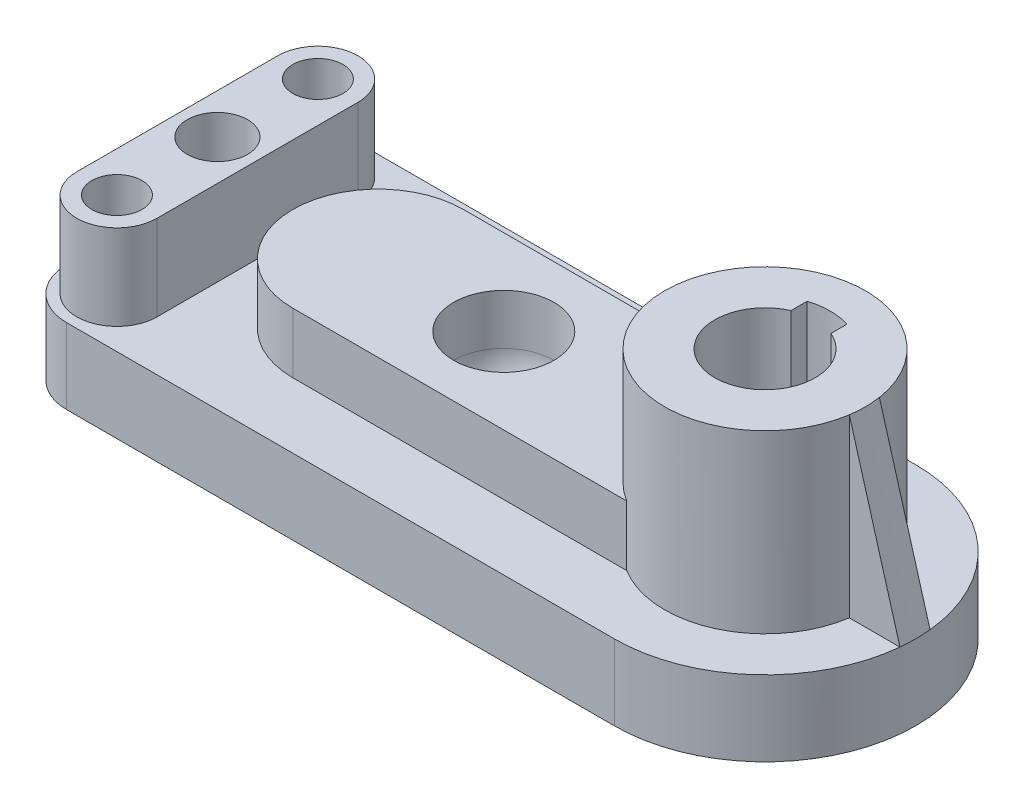
ISO-10303-21;
HEADER;
FILE_DESCRIPTION(('STEP AP214'),'2;1');
FILE_NAME('part.step','',(''),(''),'','','');
FILE_SCHEMA(('AUTOMOTIVE_DESIGN { 1 0 10303 214 1 1 1 1 }'));
ENDSEC;
DATA;
#1=APPLICATION_CONTEXT('core data for automotive mechanical design processes');
#2=APPLICATION_PROTOCOL_DEFINITION('international standard','automotive_design',2000,#1);
#3=PRODUCT_CONTEXT('',#1,'mechanical');
#4=PRODUCT('Part','Part','',(#3));
#5=PRODUCT_RELATED_PRODUCT_CATEGORY('part','',(#4));
#6=PRODUCT_DEFINITION_FORMATION('','',#4);
#7=PRODUCT_DEFINITION_CONTEXT('part definition',#1,'design');
#8=PRODUCT_DEFINITION('design','',#6,#7);
#9=PRODUCT_DEFINITION_SHAPE('','',#8);
#10=(LENGTH_UNIT() NAMED_UNIT(*) SI_UNIT(.MILLI.,.METRE.));
#11=(NAMED_UNIT(*) PLANE_ANGLE_UNIT() SI_UNIT($,.RADIAN.));
#12=(NAMED_UNIT(*) SI_UNIT($,.STERADIAN.) SOLID_ANGLE_UNIT());
#13=UNCERTAINTY_MEASURE_WITH_UNIT(LENGTH_MEASURE(1.E-05),#10,'distance_accuracy_value','');
#14=(GEOMETRIC_REPRESENTATION_CONTEXT(3) GLOBAL_UNCERTAINTY_ASSIGNED_CONTEXT((#13)) GLOBAL_UNIT_ASSIGNED_CONTEXT((#10,
#11,#12)) REPRESENTATION_CONTEXT('',''));
#15=CARTESIAN_POINT('',(0.,0.,0.));
#16=DIRECTION('',(0.,0.,1.));
#17=DIRECTION('',(1.,0.,0.));
#18=AXIS2_PLACEMENT_3D('',#15,#16,#17);
#19=CARTESIAN_POINT('',(119.,15.,-30.));
#20=DIRECTION('',(0.,-1.,0.));
#21=DIRECTION('',(0.,0.,-1.));
#22=AXIS2_PLACEMENT_3D('',#19,#20,#21);
#23=PLANE('',#22);
#24=CARTESIAN_POINT('',(10.,15.,-50.));
#25=DIRECTION('',(0.,1.,0.));
#26=DIRECTION('',(0.,0.,1.));
#27=AXIS2_PLACEMENT_3D('',#24,#25,#26);
#28=CIRCLE('',#27,8.00000000000001);
#29=CARTESIAN_POINT('',(18.,15.,-50.));
#30=VERTEX_POINT('',#29);
#31=CARTESIAN_POINT('',(1.99999999999997,15.,-50.));
#32=VERTEX_POINT('',#31);
#33=EDGE_CURVE('E309',#30,#32,#28,.T.);
#34=ORIENTED_EDGE('',*,*,#33,.F.);
#35=DIRECTION('',(0.,0.,-1.));
#36=VECTOR('',#35,1.);
#37=CARTESIAN_POINT('',(18.,15.,-50.));
#38=LINE('',#37,#36);
#39=CARTESIAN_POINT('',(18.,15.,-10.));
#40=VERTEX_POINT('',#39);
#41=EDGE_CURVE('E314',#40,#30,#38,.T.);
#42=ORIENTED_EDGE('',*,*,#41,.F.);
#43=CARTESIAN_POINT('',(10.,15.,-9.99999999999999));
#44=DIRECTION('',(0.,1.,0.));
#45=DIRECTION('',(0.,0.,1.));
#46=AXIS2_PLACEMENT_3D('',#43,#44,#45);
#47=CIRCLE('',#46,8.00000000000001);
#48=CARTESIAN_POINT('',(1.99999999999999,15.,-10.));
#49=VERTEX_POINT('',#48);
#50=EDGE_CURVE('E326',#49,#40,#47,.T.);
#51=ORIENTED_EDGE('',*,*,#50,.F.);
#52=DIRECTION('',(0.,0.,1.));
#53=VECTOR('',#52,1.);
#54=CARTESIAN_POINT('',(1.99999999999998,15.,-50.));
#55=LINE('',#54,#53);
#56=EDGE_CURVE('E323',#32,#49,#55,.T.);
#57=ORIENTED_EDGE('',*,*,#56,.F.);
#58=EDGE_LOOP('',(#34,#42,#51,#57));
#59=FACE_BOUND('',#58,.T.);
#60=DIRECTION('',(1.,0.,0.));
#61=VECTOR('',#60,1.);
#62=CARTESIAN_POINT('',(42.,15.,-13.));
#63=LINE('',#62,#61);
#64=CARTESIAN_POINT('',(42.,15.,-13.));
#65=VERTEX_POINT('',#64);
#66=CARTESIAN_POINT('',(108.464346247147,15.,-13.));
#67=VERTEX_POINT('',#66);
#68=EDGE_CURVE('E532',#65,#67,#63,.T.);
#69=ORIENTED_EDGE('',*,*,#68,.F.);
#70=CARTESIAN_POINT('',(42.,15.,-30.));
#71=DIRECTION('',(0.,1.,0.));
#72=DIRECTION('',(0.,0.,1.));
#73=AXIS2_PLACEMENT_3D('',#70,#71,#72);
#74=CIRCLE('',#73,17.);
#75=CARTESIAN_POINT('',(42.,15.,-47.));
#76=VERTEX_POINT('',#75);
#77=EDGE_CURVE('E214',#76,#65,#74,.T.);
#78=ORIENTED_EDGE('',*,*,#77,.F.);
#79=DIRECTION('',(-1.,0.,0.));
#80=VECTOR('',#79,1.);
#81=CARTESIAN_POINT('',(42.,15.,-47.));
#82=LINE('',#81,#80);
#83=CARTESIAN_POINT('',(108.464346247147,15.,-47.));
#84=VERTEX_POINT('',#83);
#85=EDGE_CURVE('E210',#84,#76,#82,.T.);
#86=ORIENTED_EDGE('',*,*,#85,.F.);
#87=CARTESIAN_POINT('',(119.,15.,-30.));
#88=DIRECTION('',(0.,-1.,0.));
#89=DIRECTION('',(0.,0.,-1.));
#90=AXIS2_PLACEMENT_3D('',#87,#88,#89);
#91=CIRCLE('',#90,20.);
#92=CARTESIAN_POINT('',(138.773719933285,15.,-33.));
#93=VERTEX_POINT('',#92);
#94=EDGE_CURVE('E472',#93,#84,#91,.F.);
#95=ORIENTED_EDGE('',*,*,#94,.F.);
#96=DIRECTION('',(-1.,0.,0.));
#97=VECTOR('',#96,1.);
#98=CARTESIAN_POINT('',(148.849623113199,15.,-33.));
#99=LINE('',#98,#97);
#100=CARTESIAN_POINT('',(148.848412759468,15.,-32.9999999997389));
#101=VERTEX_POINT('',#100);
#102=EDGE_CURVE('E463',#101,#93,#99,.T.);
#103=ORIENTED_EDGE('',*,*,#102,.F.);
#104=CARTESIAN_POINT('',(119.,15.,-30.));
#105=DIRECTION('',(0.,1.,0.));
#106=DIRECTION('',(0.,0.,-1.));
#107=AXIS2_PLACEMENT_3D('',#104,#105,#106);
#108=CIRCLE('',#107,30.);
#109=CARTESIAN_POINT('',(119.,15.,-60.));
#110=VERTEX_POINT('',#109);
#111=EDGE_CURVE('E349',#101,#110,#108,.T.);
#112=ORIENTED_EDGE('',*,*,#111,.T.);
#113=DIRECTION('',(-1.,0.,0.));
#114=VECTOR('',#113,1.);
#115=CARTESIAN_POINT('',(10.0000000000001,15.,-60.));
#116=LINE('',#115,#114);
#117=CARTESIAN_POINT('',(10.0000000000001,15.,-60.));
#118=VERTEX_POINT('',#117);
#119=EDGE_CURVE('E345',#110,#118,#116,.T.);
#120=ORIENTED_EDGE('',*,*,#119,.T.);
#121=CARTESIAN_POINT('',(10.,15.,-50.));
#122=DIRECTION('',(0.,1.,0.));
#123=DIRECTION('',(0.,0.,1.));
#124=AXIS2_PLACEMENT_3D('',#121,#122,#123);
#125=CIRCLE('',#124,10.);
#126=CARTESIAN_POINT('',(0.,15.,-49.9999999999999));
#127=VERTEX_POINT('',#126);
#128=EDGE_CURVE('E512',#118,#127,#125,.T.);
#129=ORIENTED_EDGE('',*,*,#128,.T.);
#130=DIRECTION('',(0.,0.,1.));
#131=VECTOR('',#130,1.);
#132=CARTESIAN_POINT('',(0.,15.,-10.0000000000001));
#133=LINE('',#132,#131);
#134=CARTESIAN_POINT('',(0.,15.,-10.0000000000001));
#135=VERTEX_POINT('',#134);
#136=EDGE_CURVE('E511',#127,#135,#133,.T.);
#137=ORIENTED_EDGE('',*,*,#136,.T.);
#138=CARTESIAN_POINT('',(10.,15.,-10.));
#139=DIRECTION('',(0.,1.,0.));
#140=DIRECTION('',(0.,0.,1.));
#141=AXIS2_PLACEMENT_3D('',#138,#139,#140);
#142=CIRCLE('',#141,10.);
#143=CARTESIAN_POINT('',(10.,15.,0.));
#144=VERTEX_POINT('',#143);
#145=EDGE_CURVE('E509',#135,#144,#142,.T.);
#146=ORIENTED_EDGE('',*,*,#145,.T.);
#147=DIRECTION('',(1.,0.,0.));
#148=VECTOR('',#147,1.);
#149=CARTESIAN_POINT('',(10.0000000000001,15.,0.));
#150=LINE('',#149,#148);
#151=CARTESIAN_POINT('',(119.,15.,0.));
#152=VERTEX_POINT('',#151);
#153=EDGE_CURVE('E495',#144,#152,#150,.T.);
#154=ORIENTED_EDGE('',*,*,#153,.T.);
#155=CARTESIAN_POINT('',(148.849623113199,15.,-27.));
#156=VERTEX_POINT('',#155);
#157=EDGE_CURVE('E353',#152,#156,#108,.T.);
#158=ORIENTED_EDGE('',*,*,#157,.T.);
#159=DIRECTION('',(1.,0.,0.));
#160=VECTOR('',#159,1.);
#161=CARTESIAN_POINT('',(148.849623113199,15.,-27.));
#162=LINE('',#161,#160);
#163=CARTESIAN_POINT('',(138.773719933285,15.,-27.));
#164=VERTEX_POINT('',#163);
#165=EDGE_CURVE('E253',#164,#156,#162,.T.);
#166=ORIENTED_EDGE('',*,*,#165,.F.);
#167=EDGE_CURVE('E476',#67,#164,#91,.F.);
#168=ORIENTED_EDGE('',*,*,#167,.F.);
#169=EDGE_LOOP('',(#69,#78,#86,#95,#103,#112,#120,#129,#137,#146,#154,#158,#166,#168));
#170=FACE_BOUND('',#169,.T.);
#171=ADVANCED_FACE('F45',(#59,#170),#23,.F.);
#172=CARTESIAN_POINT('',(119.,50.,-30.));
#173=DIRECTION('',(0.,-1.,0.));
#174=DIRECTION('',(0.,0.,-1.));
#175=AXIS2_PLACEMENT_3D('',#172,#173,#174);
#176=CYLINDRICAL_SURFACE('',#175,20.);
#177=DIRECTION('',(0.,-1.,0.));
#178=VECTOR('',#177,1.);
#179=CARTESIAN_POINT('',(108.464346247147,27.,-13.));
#180=LINE('',#179,#178);
#181=CARTESIAN_POINT('',(108.464346247147,27.,-13.));
#182=VERTEX_POINT('',#181);
#183=EDGE_CURVE('E61',#182,#67,#180,.T.);
#184=ORIENTED_EDGE('',*,*,#183,.T.);
#185=ORIENTED_EDGE('',*,*,#167,.T.);
#186=DIRECTION('',(0.,-1.,0.));
#187=VECTOR('',#186,1.);
#188=CARTESIAN_POINT('',(138.773719933285,50.,-27.));
#189=LINE('',#188,#187);
#190=CARTESIAN_POINT('',(138.773719933285,50.,-26.9999999999997));
#191=VERTEX_POINT('',#190);
#192=EDGE_CURVE('E249',#191,#164,#189,.T.);
#193=ORIENTED_EDGE('',*,*,#192,.F.);
#194=CARTESIAN_POINT('',(119.,50.,-30.));
#195=DIRECTION('',(0.,1.,0.));
#196=DIRECTION('',(0.,0.,1.));
#197=AXIS2_PLACEMENT_3D('',#194,#195,#196);
#198=CIRCLE('',#197,20.);
#199=CARTESIAN_POINT('',(138.773719933285,50.0000000000078,-33.));
#200=VERTEX_POINT('',#199);
#201=EDGE_CURVE('E282',#200,#191,#198,.T.);
#202=ORIENTED_EDGE('',*,*,#201,.F.);
#203=DIRECTION('',(0.,-1.,0.));
#204=VECTOR('',#203,1.);
#205=CARTESIAN_POINT('',(138.773719933285,50.,-33.));
#206=LINE('',#205,#204);
#207=CARTESIAN_POINT('',(138.773719933285,49.9429961550341,-33.));
#208=VERTEX_POINT('',#207);
#209=EDGE_CURVE('E254',#200,#208,#206,.T.);
#210=ORIENTED_EDGE('',*,*,#209,.T.);
#211=EDGE_CURVE('E252',#208,#93,#206,.T.);
#212=ORIENTED_EDGE('',*,*,#211,.T.);
#213=ORIENTED_EDGE('',*,*,#94,.T.);
#214=DIRECTION('',(0.,-1.,0.));
#215=VECTOR('',#214,1.);
#216=CARTESIAN_POINT('',(108.464346247147,27.,-47.));
#217=LINE('',#216,#215);
#218=CARTESIAN_POINT('',(108.464346247147,27.,-47.));
#219=VERTEX_POINT('',#218);
#220=EDGE_CURVE('E221',#219,#84,#217,.T.);
#221=ORIENTED_EDGE('',*,*,#220,.F.);
#222=CARTESIAN_POINT('',(119.,27.,-30.));
#223=DIRECTION('',(0.,-1.,0.));
#224=DIRECTION('',(0.,0.,-1.));
#225=AXIS2_PLACEMENT_3D('',#222,#223,#224);
#226=CIRCLE('',#225,20.);
#227=EDGE_CURVE('E200',#182,#219,#226,.T.);
#228=ORIENTED_EDGE('',*,*,#227,.F.);
#229=EDGE_LOOP('',(#184,#185,#193,#202,#210,#212,#213,#221,#228));
#230=FACE_BOUND('',#229,.T.);
#231=ADVANCED_FACE('F413',(#230),#176,.T.);
#232=CARTESIAN_POINT('',(119.,15.,-30.));
#233=DIRECTION('',(0.,-1.,0.));
#234=DIRECTION('',(0.,0.,-1.));
#235=AXIS2_PLACEMENT_3D('',#232,#233,#234);
#236=CYLINDRICAL_SURFACE('',#235,30.);
#237=CARTESIAN_POINT('',(148.683329026034,15.,-25.6200798372027));
#238=CARTESIAN_POINT('',(148.7461515347,15.,-26.0781329495942));
#239=CARTESIAN_POINT('',(148.80324498006,14.9999999999956,-26.5385432076493));
#240=CARTESIAN_POINT('',(148.929393058684,15.0000000000076,-27.7937012699372));
#241=CARTESIAN_POINT('',(148.977444297386,15.0000000000048,-28.5918725024124));
#242=CARTESIAN_POINT('',(149.001784624181,14.9999999999976,-29.790289799225));
#243=CARTESIAN_POINT('',(149.001941979064,14.9999999999976,-30.189955568258));
#244=CARTESIAN_POINT('',(148.986318105774,15.0000000000024,-30.9887494805969));
#245=CARTESIAN_POINT('',(148.970537510806,15.,-31.3878778418723));
#246=CARTESIAN_POINT('',(148.92300879648,15.,-32.1846717711496));
#247=CARTESIAN_POINT('',(148.889746147584,14.9999999999986,-32.5818173558762));
#248=CARTESIAN_POINT('',(148.809168960563,15.0000000000014,-33.3739863199389));
#249=CARTESIAN_POINT('',(148.761855052781,14.9999999999996,-33.7690099168121));
#250=CARTESIAN_POINT('',(148.606260132419,15.0000000000007,-34.9514708413386));
#251=CARTESIAN_POINT('',(148.484325915738,14.9999999999519,-35.7362983035718));
#252=CARTESIAN_POINT('',(148.363981386982,15.,-36.5191733820323));
#253=B_SPLINE_CURVE_WITH_KNOTS('',3,(#237,#238,#239,#240,#241,#242,#243,#244,#245,#246,#247,
#248,#249,#250,#251,#252),.UNSPECIFIED.,.F.,.F.,(4,2,2,2,2,2,2,4),(0.,0.126904169331537,
0.345178126998653,0.454315105832211,0.563452084665769,0.672589063499327,0.781726042332884,1.),.UNSPECIFIED.);
#254=EDGE_CURVE('E219',#156,#101,#253,.T.);
#255=ORIENTED_EDGE('',*,*,#254,.F.);
#256=ORIENTED_EDGE('',*,*,#157,.F.);
#257=DIRECTION('',(0.,-1.,0.));
#258=VECTOR('',#257,1.);
#259=CARTESIAN_POINT('',(119.,15.,0.));
#260=LINE('',#259,#258);
#261=CARTESIAN_POINT('',(119.,0.,0.));
#262=VERTEX_POINT('',#261);
#263=EDGE_CURVE('E492',#152,#262,#260,.T.);
#264=ORIENTED_EDGE('',*,*,#263,.T.);
#265=CARTESIAN_POINT('',(119.,0.,-30.));
#266=DIRECTION('',(0.,1.,0.));
#267=DIRECTION('',(0.,0.,-1.));
#268=AXIS2_PLACEMENT_3D('',#265,#266,#267);
#269=CIRCLE('',#268,30.);
#270=CARTESIAN_POINT('',(119.,0.,-60.));
#271=VERTEX_POINT('',#270);
#272=EDGE_CURVE('E342',#262,#271,#269,.T.);
#273=ORIENTED_EDGE('',*,*,#272,.T.);
#274=DIRECTION('',(0.,-1.,0.));
#275=VECTOR('',#274,1.);
#276=CARTESIAN_POINT('',(119.,15.,-60.));
#277=LINE('',#276,#275);
#278=EDGE_CURVE('E477',#110,#271,#277,.T.);
#279=ORIENTED_EDGE('',*,*,#278,.F.);
#280=ORIENTED_EDGE('',*,*,#111,.F.);
#281=EDGE_LOOP('',(#255,#256,#264,#273,#279,#280));
#282=FACE_BOUND('',#281,.T.);
#283=ADVANCED_FACE('F419',(#282),#236,.T.);
#284=CARTESIAN_POINT('',(10.0000000000001,15.,-60.));
#285=DIRECTION('',(0.,0.,1.));
#286=DIRECTION('',(1.,0.,0.));
#287=AXIS2_PLACEMENT_3D('',#284,#285,#286);
#288=PLANE('',#287);
#289=DIRECTION('',(-1.,0.,0.));
#290=VECTOR('',#289,1.);
#291=CARTESIAN_POINT('',(10.0000000000001,0.,-60.));
#292=LINE('',#291,#290);
#293=CARTESIAN_POINT('',(10.0000000000001,0.,-60.));
#294=VERTEX_POINT('',#293);
#295=EDGE_CURVE('E504',#271,#294,#292,.T.);
#296=ORIENTED_EDGE('',*,*,#295,.T.);
#297=DIRECTION('',(0.,-1.,0.));
#298=VECTOR('',#297,1.);
#299=CARTESIAN_POINT('',(10.0000000000001,15.,-60.));
#300=LINE('',#299,#298);
#301=EDGE_CURVE('E480',#118,#294,#300,.T.);
#302=ORIENTED_EDGE('',*,*,#301,.F.);
#303=ORIENTED_EDGE('',*,*,#119,.F.);
#304=ORIENTED_EDGE('',*,*,#278,.T.);
#305=EDGE_LOOP('',(#296,#302,#303,#304));
#306=FACE_BOUND('',#305,.T.);
#307=ADVANCED_FACE('F447',(#306),#288,.F.);
#308=CARTESIAN_POINT('',(10.,15.,-50.));
#309=DIRECTION('',(0.,-1.,0.));
#310=DIRECTION('',(0.,0.,-1.));
#311=AXIS2_PLACEMENT_3D('',#308,#309,#310);
#312=CYLINDRICAL_SURFACE('',#311,10.);
#313=CARTESIAN_POINT('',(10.,0.,-50.));
#314=DIRECTION('',(0.,1.,0.));
#315=DIRECTION('',(0.,0.,1.));
#316=AXIS2_PLACEMENT_3D('',#313,#314,#315);
#317=CIRCLE('',#316,10.);
#318=CARTESIAN_POINT('',(0.,0.,-49.9999999999999));
#319=VERTEX_POINT('',#318);
#320=EDGE_CURVE('E502',#294,#319,#317,.T.);
#321=ORIENTED_EDGE('',*,*,#320,.T.);
#322=DIRECTION('',(0.,-1.,0.));
#323=VECTOR('',#322,1.);
#324=CARTESIAN_POINT('',(0.,15.,-49.9999999999999));
#325=LINE('',#324,#323);
#326=EDGE_CURVE('E483',#127,#319,#325,.T.);
#327=ORIENTED_EDGE('',*,*,#326,.F.);
#328=ORIENTED_EDGE('',*,*,#128,.F.);
#329=ORIENTED_EDGE('',*,*,#301,.T.);
#330=EDGE_LOOP('',(#321,#327,#328,#329));
#331=FACE_BOUND('',#330,.T.);
#332=ADVANCED_FACE('F443',(#331),#312,.T.);
#333=CARTESIAN_POINT('',(0.,15.,-10.0000000000001));
#334=DIRECTION('',(1.,0.,0.));
#335=DIRECTION('',(0.,0.,-1.));
#336=AXIS2_PLACEMENT_3D('',#333,#334,#335);
#337=PLANE('',#336);
#338=DIRECTION('',(0.,0.,1.));
#339=VECTOR('',#338,1.);
#340=CARTESIAN_POINT('',(0.,0.,-10.0000000000001));
#341=LINE('',#340,#339);
#342=CARTESIAN_POINT('',(0.,0.,-10.0000000000001));
#343=VERTEX_POINT('',#342);
#344=EDGE_CURVE('E500',#319,#343,#341,.T.);
#345=ORIENTED_EDGE('',*,*,#344,.T.);
#346=DIRECTION('',(0.,-1.,0.));
#347=VECTOR('',#346,1.);
#348=CARTESIAN_POINT('',(0.,15.,-10.0000000000001));
#349=LINE('',#348,#347);
#350=EDGE_CURVE('E486',#135,#343,#349,.T.);
#351=ORIENTED_EDGE('',*,*,#350,.F.);
#352=ORIENTED_EDGE('',*,*,#136,.F.);
#353=ORIENTED_EDGE('',*,*,#326,.T.);
#354=EDGE_LOOP('',(#345,#351,#352,#353));
#355=FACE_BOUND('',#354,.T.);
#356=ADVANCED_FACE('F439',(#355),#337,.F.);
#357=CARTESIAN_POINT('',(10.,15.,-10.));
#358=DIRECTION('',(0.,-1.,0.));
#359=DIRECTION('',(0.,0.,-1.));
#360=AXIS2_PLACEMENT_3D('',#357,#358,#359);
#361=CYLINDRICAL_SURFACE('',#360,10.);
#362=CARTESIAN_POINT('',(10.,0.,-10.));
#363=DIRECTION('',(0.,1.,0.));
#364=DIRECTION('',(0.,0.,1.));
#365=AXIS2_PLACEMENT_3D('',#362,#363,#364);
#366=CIRCLE('',#365,10.);
#367=CARTESIAN_POINT('',(10.,0.,0.));
#368=VERTEX_POINT('',#367);
#369=EDGE_CURVE('E498',#343,#368,#366,.T.);
#370=ORIENTED_EDGE('',*,*,#369,.T.);
#371=DIRECTION('',(0.,-1.,0.));
#372=VECTOR('',#371,1.);
#373=CARTESIAN_POINT('',(10.,15.,0.));
#374=LINE('',#373,#372);
#375=EDGE_CURVE('E489',#144,#368,#374,.T.);
#376=ORIENTED_EDGE('',*,*,#375,.F.);
#377=ORIENTED_EDGE('',*,*,#145,.F.);
#378=ORIENTED_EDGE('',*,*,#350,.T.);
#379=EDGE_LOOP('',(#370,#376,#377,#378));
#380=FACE_BOUND('',#379,.T.);
#381=ADVANCED_FACE('F435',(#380),#361,.T.);
#382=CARTESIAN_POINT('',(10.0000000000001,15.,0.));
#383=DIRECTION('',(0.,0.,-1.));
#384=DIRECTION('',(-1.,0.,0.));
#385=AXIS2_PLACEMENT_3D('',#382,#383,#384);
#386=PLANE('',#385);
#387=DIRECTION('',(1.,0.,0.));
#388=VECTOR('',#387,1.);
#389=CARTESIAN_POINT('',(10.0000000000001,0.,0.));
#390=LINE('',#389,#388);
#391=EDGE_CURVE('E496',#368,#262,#390,.T.);
#392=ORIENTED_EDGE('',*,*,#391,.T.);
#393=ORIENTED_EDGE('',*,*,#263,.F.);
#394=ORIENTED_EDGE('',*,*,#153,.F.);
#395=ORIENTED_EDGE('',*,*,#375,.T.);
#396=EDGE_LOOP('',(#392,#393,#394,#395));
#397=FACE_BOUND('',#396,.T.);
#398=ADVANCED_FACE('F431',(#397),#386,.F.);
#399=CARTESIAN_POINT('',(119.,0.,-30.));
#400=DIRECTION('',(0.,-1.,0.));
#401=DIRECTION('',(0.,0.,-1.));
#402=AXIS2_PLACEMENT_3D('',#399,#400,#401);
#403=PLANE('',#402);
#404=CARTESIAN_POINT('',(67.,0.,-30.));
#405=DIRECTION('',(0.,-1.,0.));
#406=DIRECTION('',(0.,0.,-1.));
#407=AXIS2_PLACEMENT_3D('',#404,#405,#406);
#408=CIRCLE('',#407,3.00000000000001);
#409=CARTESIAN_POINT('',(67.,0.,-33.));
#410=VERTEX_POINT('',#409);
#411=EDGE_CURVE('E846',#410,#410,#408,.T.);
#412=ORIENTED_EDGE('',*,*,#411,.F.);
#413=EDGE_LOOP('',(#412));
#414=FACE_BOUND('',#413,.T.);
#415=CARTESIAN_POINT('',(119.,0.,-30.));
#416=DIRECTION('',(0.,-1.,0.));
#417=DIRECTION('',(0.,0.,-1.));
#418=AXIS2_PLACEMENT_3D('',#415,#416,#417);
#419=CIRCLE('',#418,13.);
#420=CARTESIAN_POINT('',(119.,0.,-43.));
#421=VERTEX_POINT('',#420);
#422=EDGE_CURVE('E257',#421,#421,#419,.T.);
#423=ORIENTED_EDGE('',*,*,#422,.F.);
#424=EDGE_LOOP('',(#423));
#425=FACE_BOUND('',#424,.T.);
#426=CARTESIAN_POINT('',(10.,0.,-50.));
#427=DIRECTION('',(0.,-1.,0.));
#428=DIRECTION('',(0.,0.,-1.));
#429=AXIS2_PLACEMENT_3D('',#426,#427,#428);
#430=CIRCLE('',#429,5.);
#431=CARTESIAN_POINT('',(10.,0.,-55.));
#432=VERTEX_POINT('',#431);
#433=EDGE_CURVE('E294',#432,#432,#430,.T.);
#434=ORIENTED_EDGE('',*,*,#433,.F.);
#435=EDGE_LOOP('',(#434));
#436=FACE_BOUND('',#435,.T.);
#437=CARTESIAN_POINT('',(10.,0.,-30.));
#438=DIRECTION('',(0.,-1.,0.));
#439=DIRECTION('',(0.,0.,-1.));
#440=AXIS2_PLACEMENT_3D('',#437,#438,#439);
#441=CIRCLE('',#440,6.);
#442=CARTESIAN_POINT('',(10.,0.,-36.));
#443=VERTEX_POINT('',#442);
#444=EDGE_CURVE('E291',#443,#443,#441,.T.);
#445=ORIENTED_EDGE('',*,*,#444,.F.);
#446=EDGE_LOOP('',(#445));
#447=FACE_BOUND('',#446,.T.);
#448=CARTESIAN_POINT('',(10.,0.,-9.99999999999999));
#449=DIRECTION('',(0.,-1.,0.));
#450=DIRECTION('',(0.,0.,-1.));
#451=AXIS2_PLACEMENT_3D('',#448,#449,#450);
#452=CIRCLE('',#451,5.);
#453=CARTESIAN_POINT('',(10.,0.,-15.));
#454=VERTEX_POINT('',#453);
#455=EDGE_CURVE('E297',#454,#454,#452,.T.);
#456=ORIENTED_EDGE('',*,*,#455,.F.);
#457=EDGE_LOOP('',(#456));
#458=FACE_BOUND('',#457,.T.);
#459=ORIENTED_EDGE('',*,*,#272,.F.);
#460=ORIENTED_EDGE('',*,*,#391,.F.);
#461=ORIENTED_EDGE('',*,*,#369,.F.);
#462=ORIENTED_EDGE('',*,*,#344,.F.);
#463=ORIENTED_EDGE('',*,*,#320,.F.);
#464=ORIENTED_EDGE('',*,*,#295,.F.);
#465=EDGE_LOOP('',(#459,#460,#461,#462,#463,#464));
#466=FACE_BOUND('',#465,.T.);
#467=ADVANCED_FACE('F427',(#414,#425,#436,#447,#458,#466),#403,.T.);
#468=CARTESIAN_POINT('',(10.,32.,-50.));
#469=DIRECTION('',(0.,1.,0.));
#470=DIRECTION('',(0.,0.,1.));
#471=AXIS2_PLACEMENT_3D('',#468,#469,#470);
#472=PLANE('',#471);
#473=CARTESIAN_POINT('',(10.,32.,-9.99999999999999));
#474=DIRECTION('',(0.,1.,0.));
#475=DIRECTION('',(0.,0.,1.));
#476=AXIS2_PLACEMENT_3D('',#473,#474,#475);
#477=CIRCLE('',#476,5.);
#478=CARTESIAN_POINT('',(10.,32.,-4.99999999999999));
#479=VERTEX_POINT('',#478);
#480=EDGE_CURVE('E303',#479,#479,#477,.T.);
#481=ORIENTED_EDGE('',*,*,#480,.F.);
#482=EDGE_LOOP('',(#481));
#483=FACE_BOUND('',#482,.T.);
#484=CARTESIAN_POINT('',(10.,32.,-50.));
#485=DIRECTION('',(0.,1.,0.));
#486=DIRECTION('',(0.,0.,1.));
#487=AXIS2_PLACEMENT_3D('',#484,#485,#486);
#488=CIRCLE('',#487,8.00000000000001);
#489=CARTESIAN_POINT('',(18.,32.,-50.));
#490=VERTEX_POINT('',#489);
#491=CARTESIAN_POINT('',(1.99999999999998,32.,-50.));
#492=VERTEX_POINT('',#491);
#493=EDGE_CURVE('E310',#490,#492,#488,.T.);
#494=ORIENTED_EDGE('',*,*,#493,.T.);
#495=DIRECTION('',(0.,0.,1.));
#496=VECTOR('',#495,1.);
#497=CARTESIAN_POINT('',(1.99999999999998,32.,-50.));
#498=LINE('',#497,#496);
#499=CARTESIAN_POINT('',(1.99999999999999,32.,-10.));
#500=VERTEX_POINT('',#499);
#501=EDGE_CURVE('E313',#492,#500,#498,.T.);
#502=ORIENTED_EDGE('',*,*,#501,.T.);
#503=CARTESIAN_POINT('',(10.,32.,-9.99999999999999));
#504=DIRECTION('',(0.,1.,0.));
#505=DIRECTION('',(0.,0.,1.));
#506=AXIS2_PLACEMENT_3D('',#503,#504,#505);
#507=CIRCLE('',#506,8.00000000000001);
#508=CARTESIAN_POINT('',(18.,32.,-10.));
#509=VERTEX_POINT('',#508);
#510=EDGE_CURVE('E316',#500,#509,#507,.T.);
#511=ORIENTED_EDGE('',*,*,#510,.T.);
#512=DIRECTION('',(0.,0.,-1.));
#513=VECTOR('',#512,1.);
#514=CARTESIAN_POINT('',(18.,32.,-50.));
#515=LINE('',#514,#513);
#516=EDGE_CURVE('E318',#509,#490,#515,.T.);
#517=ORIENTED_EDGE('',*,*,#516,.T.);
#518=EDGE_LOOP('',(#494,#502,#511,#517));
#519=FACE_BOUND('',#518,.T.);
#520=CARTESIAN_POINT('',(10.,32.,-50.));
#521=DIRECTION('',(0.,1.,0.));
#522=DIRECTION('',(0.,0.,1.));
#523=AXIS2_PLACEMENT_3D('',#520,#521,#522);
#524=CIRCLE('',#523,5.);
#525=CARTESIAN_POINT('',(10.,32.,-45.));
#526=VERTEX_POINT('',#525);
#527=EDGE_CURVE('E306',#526,#526,#524,.T.);
#528=ORIENTED_EDGE('',*,*,#527,.F.);
#529=EDGE_LOOP('',(#528));
#530=FACE_BOUND('',#529,.T.);
#531=CARTESIAN_POINT('',(10.,32.,-30.));
#532=DIRECTION('',(0.,1.,0.));
#533=DIRECTION('',(0.,0.,1.));
#534=AXIS2_PLACEMENT_3D('',#531,#532,#533);
#535=CIRCLE('',#534,6.);
#536=CARTESIAN_POINT('',(10.,32.,-24.));
#537=VERTEX_POINT('',#536);
#538=EDGE_CURVE('E300',#537,#537,#535,.T.);
#539=ORIENTED_EDGE('',*,*,#538,.F.);
#540=EDGE_LOOP('',(#539));
#541=FACE_BOUND('',#540,.T.);
#542=ADVANCED_FACE('F430',(#483,#519,#530,#541),#472,.T.);
#543=CARTESIAN_POINT('',(10.,32.,-50.));
#544=DIRECTION('',(0.,-1.,0.));
#545=DIRECTION('',(0.,0.,-1.));
#546=AXIS2_PLACEMENT_3D('',#543,#544,#545);
#547=CYLINDRICAL_SURFACE('',#546,8.00000000000001);
#548=ORIENTED_EDGE('',*,*,#33,.T.);
#549=DIRECTION('',(0.,-1.,0.));
#550=VECTOR('',#549,1.);
#551=CARTESIAN_POINT('',(1.99999999999998,32.,-50.));
#552=LINE('',#551,#550);
#553=EDGE_CURVE('E339',#492,#32,#552,.T.);
#554=ORIENTED_EDGE('',*,*,#553,.F.);
#555=ORIENTED_EDGE('',*,*,#493,.F.);
#556=DIRECTION('',(0.,-1.,0.));
#557=VECTOR('',#556,1.);
#558=CARTESIAN_POINT('',(18.,32.,-50.));
#559=LINE('',#558,#557);
#560=EDGE_CURVE('E320',#490,#30,#559,.T.);
#561=ORIENTED_EDGE('',*,*,#560,.T.);
#562=EDGE_LOOP('',(#548,#554,#555,#561));
#563=FACE_BOUND('',#562,.T.);
#564=ADVANCED_FACE('F425',(#563),#547,.T.);
#565=CARTESIAN_POINT('',(1.99999999999998,32.,-50.));
#566=DIRECTION('',(1.,0.,0.));
#567=DIRECTION('',(0.,0.,-1.));
#568=AXIS2_PLACEMENT_3D('',#565,#566,#567);
#569=PLANE('',#568);
#570=ORIENTED_EDGE('',*,*,#56,.T.);
#571=DIRECTION('',(0.,-1.,0.));
#572=VECTOR('',#571,1.);
#573=CARTESIAN_POINT('',(1.99999999999999,32.,-10.));
#574=LINE('',#573,#572);
#575=EDGE_CURVE('E336',#500,#49,#574,.T.);
#576=ORIENTED_EDGE('',*,*,#575,.F.);
#577=ORIENTED_EDGE('',*,*,#501,.F.);
#578=ORIENTED_EDGE('',*,*,#553,.T.);
#579=EDGE_LOOP('',(#570,#576,#577,#578));
#580=FACE_BOUND('',#579,.T.);
#581=ADVANCED_FACE('F586',(#580),#569,.F.);
#582=CARTESIAN_POINT('',(10.,32.,-9.99999999999999));
#583=DIRECTION('',(0.,-1.,0.));
#584=DIRECTION('',(0.,0.,-1.));
#585=AXIS2_PLACEMENT_3D('',#582,#583,#584);
#586=CYLINDRICAL_SURFACE('',#585,8.00000000000001);
#587=ORIENTED_EDGE('',*,*,#50,.T.);
#588=DIRECTION('',(0.,-1.,0.));
#589=VECTOR('',#588,1.);
#590=CARTESIAN_POINT('',(18.,32.,-10.));
#591=LINE('',#590,#589);
#592=EDGE_CURVE('E333',#509,#40,#591,.T.);
#593=ORIENTED_EDGE('',*,*,#592,.F.);
#594=ORIENTED_EDGE('',*,*,#510,.F.);
#595=ORIENTED_EDGE('',*,*,#575,.T.);
#596=EDGE_LOOP('',(#587,#593,#594,#595));
#597=FACE_BOUND('',#596,.T.);
#598=ADVANCED_FACE('F583',(#597),#586,.T.);
#599=CARTESIAN_POINT('',(18.,32.,-50.));
#600=DIRECTION('',(-1.,0.,0.));
#601=DIRECTION('',(0.,0.,1.));
#602=AXIS2_PLACEMENT_3D('',#599,#600,#601);
#603=PLANE('',#602);
#604=ORIENTED_EDGE('',*,*,#41,.T.);
#605=ORIENTED_EDGE('',*,*,#560,.F.);
#606=ORIENTED_EDGE('',*,*,#516,.F.);
#607=ORIENTED_EDGE('',*,*,#592,.T.);
#608=EDGE_LOOP('',(#604,#605,#606,#607));
#609=FACE_BOUND('',#608,.T.);
#610=ADVANCED_FACE('F576',(#609),#603,.F.);
#611=CARTESIAN_POINT('',(10.,32.,-50.));
#612=DIRECTION('',(0.,-1.,0.));
#613=DIRECTION('',(0.,0.,-1.));
#614=AXIS2_PLACEMENT_3D('',#611,#612,#613);
#615=CYLINDRICAL_SURFACE('',#614,5.);
#616=ORIENTED_EDGE('',*,*,#527,.T.);
#617=EDGE_LOOP('',(#616));
#618=FACE_BOUND('',#617,.T.);
#619=ORIENTED_EDGE('',*,*,#433,.T.);
#620=EDGE_LOOP('',(#619));
#621=FACE_BOUND('',#620,.T.);
#622=ADVANCED_FACE('F572',(#618,#621),#615,.F.);
#623=CARTESIAN_POINT('',(10.,32.,-9.99999999999999));
#624=DIRECTION('',(0.,-1.,0.));
#625=DIRECTION('',(0.,0.,-1.));
#626=AXIS2_PLACEMENT_3D('',#623,#624,#625);
#627=CYLINDRICAL_SURFACE('',#626,5.);
#628=ORIENTED_EDGE('',*,*,#480,.T.);
#629=EDGE_LOOP('',(#628));
#630=FACE_BOUND('',#629,.T.);
#631=ORIENTED_EDGE('',*,*,#455,.T.);
#632=EDGE_LOOP('',(#631));
#633=FACE_BOUND('',#632,.T.);
#634=ADVANCED_FACE('F568',(#630,#633),#627,.F.);
#635=CARTESIAN_POINT('',(10.,32.,-30.));
#636=DIRECTION('',(0.,-1.,0.));
#637=DIRECTION('',(0.,0.,-1.));
#638=AXIS2_PLACEMENT_3D('',#635,#636,#637);
#639=CYLINDRICAL_SURFACE('',#638,6.);
#640=ORIENTED_EDGE('',*,*,#538,.T.);
#641=EDGE_LOOP('',(#640));
#642=FACE_BOUND('',#641,.T.);
#643=ORIENTED_EDGE('',*,*,#444,.T.);
#644=EDGE_LOOP('',(#643));
#645=FACE_BOUND('',#644,.T.);
#646=ADVANCED_FACE('F563',(#642,#645),#639,.F.);
#647=CARTESIAN_POINT('',(119.,50.,-30.));
#648=DIRECTION('',(0.,1.,0.));
#649=DIRECTION('',(0.,0.,1.));
#650=AXIS2_PLACEMENT_3D('',#647,#648,#649);
#651=PLANE('',#650);
#652=DIRECTION('',(-1.,7.20435967914567E-13,0.));
#653=VECTOR('',#652,1.);
#654=CARTESIAN_POINT('',(148.683329026034,50.0000000000006,-33.));
#655=LINE('',#654,#653);
#656=CARTESIAN_POINT('',(138.757244149535,49.9999999999834,-32.9999999999253));
#657=VERTEX_POINT('',#656);
#658=EDGE_CURVE('E237',#200,#657,#655,.T.);
#659=ORIENTED_EDGE('',*,*,#658,.F.);
#660=ORIENTED_EDGE('',*,*,#201,.T.);
#661=CARTESIAN_POINT('',(138.614002771884,50.,-25.9840766482884));
#662=CARTESIAN_POINT('',(138.673631787039,50.0000000000016,-26.3547804913824));
#663=CARTESIAN_POINT('',(138.727341786939,49.9999999999984,-26.6948477983813));
#664=CARTESIAN_POINT('',(138.853489901487,50.0000000000028,-27.5248588686172));
#665=CARTESIAN_POINT('',(138.912307020054,49.999999999997,-28.0548053412325));
#666=CARTESIAN_POINT('',(138.968667875139,50.0000000000012,-28.8531162000475));
#667=CARTESIAN_POINT('',(138.98215308537,49.9999999999982,-29.1196145554011));
#668=CARTESIAN_POINT('',(138.998555170698,50.000000000001,-29.6521901251005));
#669=CARTESIAN_POINT('',(138.999404945831,49.9999999999994,-29.931098079681));
#670=CARTESIAN_POINT('',(138.998910763115,49.9999999999994,-30.4359720055614));
#671=CARTESIAN_POINT('',(138.993808634468,49.9999999999949,-30.6821905399789));
#672=CARTESIAN_POINT('',(138.961167138255,50.0000000000032,-31.2397367020182));
#673=CARTESIAN_POINT('',(138.935697533838,49.999999999996,-31.538188995829));
#674=CARTESIAN_POINT('',(138.833786064019,50.0000000000043,-32.4924038995069));
#675=CARTESIAN_POINT('',(138.73110336634,49.9999999999574,-33.206780940252));
#676=CARTESIAN_POINT('',(138.608066520878,49.9999999999986,-34.0000564700118));
#677=B_SPLINE_CURVE_WITH_KNOTS('',3,(#661,#662,#663,#664,#665,#666,#667,#668,#669,#670,#671,
#672,#673,#674,#675,#676),.UNSPECIFIED.,.F.,.F.,(4,2,2,2,2,2,2,4),(0.,0.126904169331537,
0.345178126998653,0.454315105832211,0.563452084665769,0.672589063499327,0.781726042332884,1.),.UNSPECIFIED.);
#678=EDGE_CURVE('E216',#191,#657,#677,.T.);
#679=ORIENTED_EDGE('',*,*,#678,.T.);
#680=EDGE_LOOP('',(#659,#660,#679));
#681=FACE_BOUND('',#680,.T.);
#682=CARTESIAN_POINT('',(119.,50.,-30.));
#683=DIRECTION('',(0.,1.,0.));
#684=DIRECTION('',(0.,0.,1.));
#685=AXIS2_PLACEMENT_3D('',#682,#683,#684);
#686=CIRCLE('',#685,10.);
#687=CARTESIAN_POINT('',(115.,50.,-39.1651513899117));
#688=VERTEX_POINT('',#687);
#689=CARTESIAN_POINT('',(122.907432902774,50.,-39.2049969098483));
#690=VERTEX_POINT('',#689);
#691=EDGE_CURVE('E260',#688,#690,#686,.T.);
#692=ORIENTED_EDGE('',*,*,#691,.F.);
#693=DIRECTION('',(0.,0.,1.));
#694=VECTOR('',#693,1.);
#695=CARTESIAN_POINT('',(115.,50.,-39.1651513899117));
#696=LINE('',#695,#694);
#697=CARTESIAN_POINT('',(115.,50.,-42.369316876853));
#698=VERTEX_POINT('',#697);
#699=EDGE_CURVE('E266',#698,#688,#696,.T.);
#700=ORIENTED_EDGE('',*,*,#699,.F.);
#701=CARTESIAN_POINT('',(119.,50.,-30.));
#702=DIRECTION('',(0.,1.,0.));
#703=DIRECTION('',(0.,0.,1.));
#704=AXIS2_PLACEMENT_3D('',#701,#702,#703);
#705=CIRCLE('',#704,13.);
#706=CARTESIAN_POINT('',(122.907432902774,50.,-42.398869630346));
#707=VERTEX_POINT('',#706);
#708=EDGE_CURVE('E275',#707,#698,#705,.T.);
#709=ORIENTED_EDGE('',*,*,#708,.F.);
#710=DIRECTION('',(0.,0.,-1.));
#711=VECTOR('',#710,1.);
#712=CARTESIAN_POINT('',(122.907432902774,50.,-39.2049969098483));
#713=LINE('',#712,#711);
#714=EDGE_CURVE('E272',#690,#707,#713,.T.);
#715=ORIENTED_EDGE('',*,*,#714,.F.);
#716=EDGE_LOOP('',(#692,#700,#709,#715));
#717=FACE_BOUND('',#716,.T.);
#718=ADVANCED_FACE('F560',(#681,#717),#651,.T.);
#719=CARTESIAN_POINT('',(119.,10.,-30.));
#720=DIRECTION('',(0.,1.,0.));
#721=DIRECTION('',(0.,0.,1.));
#722=AXIS2_PLACEMENT_3D('',#719,#720,#721);
#723=CYLINDRICAL_SURFACE('',#722,10.);
#724=ORIENTED_EDGE('',*,*,#691,.T.);
#725=DIRECTION('',(0.,1.,0.));
#726=VECTOR('',#725,1.);
#727=CARTESIAN_POINT('',(122.907432902774,10.,-39.2049969098483));
#728=LINE('',#727,#726);
#729=CARTESIAN_POINT('',(122.907432902774,10.,-39.2049969098483));
#730=VERTEX_POINT('',#729);
#731=EDGE_CURVE('E270',#730,#690,#728,.T.);
#732=ORIENTED_EDGE('',*,*,#731,.F.);
#733=CARTESIAN_POINT('',(119.,10.,-30.));
#734=DIRECTION('',(0.,1.,0.));
#735=DIRECTION('',(0.,0.,1.));
#736=AXIS2_PLACEMENT_3D('',#733,#734,#735);
#737=CIRCLE('',#736,10.);
#738=CARTESIAN_POINT('',(115.,10.,-39.1651513899117));
#739=VERTEX_POINT('',#738);
#740=EDGE_CURVE('E263',#739,#730,#737,.T.);
#741=ORIENTED_EDGE('',*,*,#740,.F.);
#742=DIRECTION('',(0.,1.,0.));
#743=VECTOR('',#742,1.);
#744=CARTESIAN_POINT('',(115.,10.,-39.1651513899117));
#745=LINE('',#744,#743);
#746=EDGE_CURVE('E280',#739,#688,#745,.T.);
#747=ORIENTED_EDGE('',*,*,#746,.T.);
#748=EDGE_LOOP('',(#724,#732,#741,#747));
#749=FACE_BOUND('',#748,.T.);
#750=ADVANCED_FACE('F550',(#749),#723,.F.);
#751=CARTESIAN_POINT('',(115.,10.,-39.1651513899117));
#752=DIRECTION('',(-1.,0.,0.));
#753=DIRECTION('',(0.,0.,1.));
#754=AXIS2_PLACEMENT_3D('',#751,#752,#753);
#755=PLANE('',#754);
#756=ORIENTED_EDGE('',*,*,#699,.T.);
#757=ORIENTED_EDGE('',*,*,#746,.F.);
#758=DIRECTION('',(0.,0.,1.));
#759=VECTOR('',#758,1.);
#760=CARTESIAN_POINT('',(115.,10.,-39.1651513899117));
#761=LINE('',#760,#759);
#762=CARTESIAN_POINT('',(115.,10.,-42.369316876853));
#763=VERTEX_POINT('',#762);
#764=EDGE_CURVE('E268',#763,#739,#761,.T.);
#765=ORIENTED_EDGE('',*,*,#764,.F.);
#766=DIRECTION('',(0.,1.,0.));
#767=VECTOR('',#766,1.);
#768=CARTESIAN_POINT('',(115.,10.,-42.369316876853));
#769=LINE('',#768,#767);
#770=EDGE_CURVE('E283',#763,#698,#769,.T.);
#771=ORIENTED_EDGE('',*,*,#770,.T.);
#772=EDGE_LOOP('',(#756,#757,#765,#771));
#773=FACE_BOUND('',#772,.T.);
#774=ADVANCED_FACE('F546',(#773),#755,.F.);
#775=CARTESIAN_POINT('',(119.,10.,-30.));
#776=DIRECTION('',(0.,1.,0.));
#777=DIRECTION('',(0.,0.,1.));
#778=AXIS2_PLACEMENT_3D('',#775,#776,#777);
#779=CYLINDRICAL_SURFACE('',#778,13.);
#780=ORIENTED_EDGE('',*,*,#708,.T.);
#781=ORIENTED_EDGE('',*,*,#770,.F.);
#782=CARTESIAN_POINT('',(119.,10.,-30.));
#783=DIRECTION('',(0.,-1.,0.));
#784=DIRECTION('',(0.,0.,-1.));
#785=AXIS2_PLACEMENT_3D('',#782,#783,#784);
#786=CIRCLE('',#785,13.);
#787=CARTESIAN_POINT('',(122.907432902774,10.,-42.398869630346));
#788=VERTEX_POINT('',#787);
#789=EDGE_CURVE('E258',#788,#763,#786,.T.);
#790=ORIENTED_EDGE('',*,*,#789,.F.);
#791=DIRECTION('',(0.,1.,0.));
#792=VECTOR('',#791,1.);
#793=CARTESIAN_POINT('',(122.907432902774,10.,-42.398869630346));
#794=LINE('',#793,#792);
#795=EDGE_CURVE('E285',#788,#707,#794,.T.);
#796=ORIENTED_EDGE('',*,*,#795,.T.);
#797=EDGE_LOOP('',(#780,#781,#790,#796));
#798=FACE_BOUND('',#797,.T.);
#799=ORIENTED_EDGE('',*,*,#422,.T.);
#800=EDGE_LOOP('',(#799));
#801=FACE_BOUND('',#800,.T.);
#802=ADVANCED_FACE('F549',(#798,#801),#779,.F.);
#803=CARTESIAN_POINT('',(122.907432902774,10.,-39.2049969098483));
#804=DIRECTION('',(1.,0.,0.));
#805=DIRECTION('',(0.,0.,-1.));
#806=AXIS2_PLACEMENT_3D('',#803,#804,#805);
#807=PLANE('',#806);
#808=ORIENTED_EDGE('',*,*,#714,.T.);
#809=ORIENTED_EDGE('',*,*,#795,.F.);
#810=DIRECTION('',(0.,0.,-1.));
#811=VECTOR('',#810,1.);
#812=CARTESIAN_POINT('',(122.907432902774,10.,-39.2049969098483));
#813=LINE('',#812,#811);
#814=EDGE_CURVE('E265',#730,#788,#813,.T.);
#815=ORIENTED_EDGE('',*,*,#814,.F.);
#816=ORIENTED_EDGE('',*,*,#731,.T.);
#817=EDGE_LOOP('',(#808,#809,#815,#816));
#818=FACE_BOUND('',#817,.T.);
#819=ADVANCED_FACE('F544',(#818),#807,.F.);
#820=CARTESIAN_POINT('',(119.,10.,-30.));
#821=DIRECTION('',(0.,-1.,0.));
#822=DIRECTION('',(0.,0.,-1.));
#823=AXIS2_PLACEMENT_3D('',#820,#821,#822);
#824=PLANE('',#823);
#825=ORIENTED_EDGE('',*,*,#814,.T.);
#826=ORIENTED_EDGE('',*,*,#789,.T.);
#827=ORIENTED_EDGE('',*,*,#764,.T.);
#828=ORIENTED_EDGE('',*,*,#740,.T.);
#829=EDGE_LOOP('',(#825,#826,#827,#828));
#830=FACE_BOUND('',#829,.T.);
#831=ADVANCED_FACE('F539',(#830),#824,.T.);
#832=CARTESIAN_POINT('',(148.849623113199,50.,-33.));
#833=DIRECTION('',(0.,0.,1.));
#834=DIRECTION('',(1.,0.,0.));
#835=AXIS2_PLACEMENT_3D('',#832,#833,#834);
#836=PLANE('',#835);
#837=ORIENTED_EDGE('',*,*,#211,.F.);
#838=CARTESIAN_POINT('',(138.757244149535,49.9999999999834,-32.9999999999626));
#839=CARTESIAN_POINT('',(139.267839721226,48.2334266118737,-32.9999999999862));
#840=CARTESIAN_POINT('',(139.778169400862,46.4667763879254,-32.9999999999962));
#841=CARTESIAN_POINT('',(140.798351683182,42.9333382872898,-33.0000000000038));
#842=CARTESIAN_POINT('',(141.308204285888,41.1665504106093,-33.0000000000013));
#843=CARTESIAN_POINT('',(142.837128608496,35.8660040904777,-32.9999999999974));
#844=CARTESIAN_POINT('',(143.855566847861,32.3320629397164,-32.9999999999993));
#845=CARTESIAN_POINT('',(145.536091468166,26.4984021862947,-33.0000000000004));
#846=CARTESIAN_POINT('',(146.198392152308,24.1987442890617,-33.0000000000004));
#847=CARTESIAN_POINT('',(147.522856049272,19.5993890170774,-32.9999999999996));
#848=CARTESIAN_POINT('',(148.185019262099,17.299691642328,-32.999999999999));
#849=CARTESIAN_POINT('',(148.847202405632,15.0000000000001,-32.9999999999984));
#850=B_SPLINE_CURVE_WITH_KNOTS('',3,(#838,#839,#840,#841,#842,#843,#844,#845,#846,#847,#848,
#849),.UNSPECIFIED.,.F.,.F.,(4,2,2,2,2,4),(0.,5.51664788705247,11.0332955069938,
22.0665906931013,29.2459790999059,36.4253671848728),.UNSPECIFIED.);
#851=EDGE_CURVE('E54',#208,#101,#850,.T.);
#852=ORIENTED_EDGE('',*,*,#851,.T.);
#853=ORIENTED_EDGE('',*,*,#102,.T.);
#854=EDGE_LOOP('',(#837,#852,#853));
#855=FACE_BOUND('',#854,.T.);
#856=ADVANCED_FACE('F535',(#855),#836,.F.);
#857=CARTESIAN_POINT('',(148.849623113199,50.,-27.));
#858=DIRECTION('',(0.,0.,-1.));
#859=DIRECTION('',(-1.,0.,0.));
#860=AXIS2_PLACEMENT_3D('',#857,#858,#859);
#861=PLANE('',#860);
#862=ORIENTED_EDGE('',*,*,#165,.T.);
#863=CARTESIAN_POINT('',(148.849623114178,15.,-27.0000000048702));
#864=CARTESIAN_POINT('',(147.832179306103,18.5342274162603,-27.0000000019433));
#865=CARTESIAN_POINT('',(146.814735498315,22.0684548326033,-27.0000000005658));
#866=CARTESIAN_POINT('',(144.779847883042,29.1369096653762,-26.9999999994342));
#867=CARTESIAN_POINT('',(143.762404075556,32.6711370818061,-26.9999999996801));
#868=CARTESIAN_POINT('',(141.421213489894,40.8035763321821,-27.0000000004162));
#869=CARTESIAN_POINT('',(140.097466711729,45.4017881661311,-27.0000000009578));
#870=CARTESIAN_POINT('',(138.773719933285,50.,-27.));
#871=B_SPLINE_CURVE_WITH_KNOTS('',3,(#863,#864,#865,#866,#867,#868,#869,#870),.UNSPECIFIED.,.F.,
.F.,(4,2,2,4),(0.,11.0332949743911,22.0665899487822,36.4214747767127),.UNSPECIFIED.);
#872=EDGE_CURVE('E240',#156,#191,#871,.T.);
#873=ORIENTED_EDGE('',*,*,#872,.T.);
#874=ORIENTED_EDGE('',*,*,#192,.T.);
#875=EDGE_LOOP('',(#862,#873,#874));
#876=FACE_BOUND('',#875,.T.);
#877=ADVANCED_FACE('F387',(#876),#861,.F.);
#878=CARTESIAN_POINT('',(148.849623113199,50.,-33.));
#879=DIRECTION('',(0.,0.,1.));
#880=DIRECTION('',(1.,0.,0.));
#881=AXIS2_PLACEMENT_3D('',#878,#879,#880);
#882=PLANE('',#881);
#883=ORIENTED_EDGE('',*,*,#209,.F.);
#884=ORIENTED_EDGE('',*,*,#658,.T.);
#885=EDGE_CURVE('E69',#657,#208,#850,.T.);
#886=ORIENTED_EDGE('',*,*,#885,.T.);
#887=EDGE_LOOP('',(#883,#884,#886));
#888=FACE_BOUND('',#887,.T.);
#889=ADVANCED_FACE('F383',(#888),#882,.T.);
#890=CARTESIAN_POINT('',(138.614002771884,50.,-25.9840766482884));
#891=CARTESIAN_POINT('',(138.673631787039,50.0000000000016,-26.3547804913824));
#892=CARTESIAN_POINT('',(138.727341786939,49.9999999999984,-26.6948477983813));
#893=CARTESIAN_POINT('',(138.853489901487,50.0000000000028,-27.5248588686172));
#894=CARTESIAN_POINT('',(138.912307020054,49.999999999997,-28.0548053412325));
#895=CARTESIAN_POINT('',(138.968667875139,50.0000000000012,-28.8531162000475));
#896=CARTESIAN_POINT('',(138.98215308537,49.9999999999982,-29.1196145554011));
#897=CARTESIAN_POINT('',(138.998555170698,50.000000000001,-29.6521901251005));
#898=CARTESIAN_POINT('',(138.999404945831,49.9999999999994,-29.931098079681));
#899=CARTESIAN_POINT('',(138.998910763115,49.9999999999994,-30.4359720055614));
#900=CARTESIAN_POINT('',(138.993808634468,49.9999999999949,-30.6821905399789));
#901=CARTESIAN_POINT('',(138.961167138255,50.0000000000032,-31.2397367020182));
#902=CARTESIAN_POINT('',(138.935697533838,49.999999999996,-31.538188995829));
#903=CARTESIAN_POINT('',(138.833786064019,50.0000000000043,-32.4924038995069));
#904=CARTESIAN_POINT('',(138.73110336634,49.9999999999574,-33.206780940252));
#905=CARTESIAN_POINT('',(138.608066520878,49.9999999999986,-34.0000564700118));
#906=CARTESIAN_POINT('',(148.683329026034,15.,-25.6200798372027));
#907=CARTESIAN_POINT('',(148.7461515347,15.,-26.0781329495942));
#908=CARTESIAN_POINT('',(148.80324498006,14.9999999999956,-26.5385432076493));
#909=CARTESIAN_POINT('',(148.929393058684,15.0000000000076,-27.7937012699372));
#910=CARTESIAN_POINT('',(148.977444297386,15.0000000000048,-28.5918725024124));
#911=CARTESIAN_POINT('',(149.001784624181,14.9999999999976,-29.790289799225));
#912=CARTESIAN_POINT('',(149.001941979064,14.9999999999976,-30.189955568258));
#913=CARTESIAN_POINT('',(148.986318105774,15.0000000000024,-30.9887494805969));
#914=CARTESIAN_POINT('',(148.970537510806,15.,-31.3878778418723));
#915=CARTESIAN_POINT('',(148.92300879648,15.,-32.1846717711496));
#916=CARTESIAN_POINT('',(148.889746147584,14.9999999999986,-32.5818173558762));
#917=CARTESIAN_POINT('',(148.809168960563,15.0000000000014,-33.3739863199389));
#918=CARTESIAN_POINT('',(148.761855052781,14.9999999999996,-33.7690099168121));
#919=CARTESIAN_POINT('',(148.606260132419,15.0000000000007,-34.9514708413386));
#920=CARTESIAN_POINT('',(148.484325915738,14.9999999999519,-35.7362983035718));
#921=CARTESIAN_POINT('',(148.363981386982,15.,-36.5191733820323));
#922=B_SPLINE_SURFACE_WITH_KNOTS('',1,3,((#890,#891,#892,#893,#894,#895,#896,#897,#898,#899,
#900,#901,#902,#903,#904,#905),(#906,#907,#908,#909,#910,#911,#912,#913,#914,#915,#916,#917,
#918,#919,#920,#921)),.UNSPECIFIED.,.F.,.F.,.F.,(2,2),(4,2,2,2,2,2,2,4),(0.,1.),(0.,
0.126904169331537,0.345178126998653,0.454315105832211,0.563452084665769,0.672589063499327,
0.781726042332884,1.),.UNSPECIFIED.);
#923=ORIENTED_EDGE('',*,*,#678,.F.);
#924=ORIENTED_EDGE('',*,*,#872,.F.);
#925=ORIENTED_EDGE('',*,*,#254,.T.);
#926=ORIENTED_EDGE('',*,*,#851,.F.);
#927=ORIENTED_EDGE('',*,*,#885,.F.);
#928=EDGE_LOOP('',(#923,#924,#925,#926,#927));
#929=FACE_BOUND('',#928,.T.);
#930=ADVANCED_FACE('F377',(#929),#922,.T.);
#931=CARTESIAN_POINT('',(42.,27.,-30.));
#932=DIRECTION('',(0.,-1.,0.));
#933=DIRECTION('',(0.,0.,-1.));
#934=AXIS2_PLACEMENT_3D('',#931,#932,#933);
#935=CYLINDRICAL_SURFACE('',#934,17.);
#936=ORIENTED_EDGE('',*,*,#77,.T.);
#937=DIRECTION('',(0.,-1.,0.));
#938=VECTOR('',#937,1.);
#939=CARTESIAN_POINT('',(42.,27.,-13.));
#940=LINE('',#939,#938);
#941=CARTESIAN_POINT('',(42.,27.,-13.));
#942=VERTEX_POINT('',#941);
#943=EDGE_CURVE('E196',#942,#65,#940,.T.);
#944=ORIENTED_EDGE('',*,*,#943,.F.);
#945=CARTESIAN_POINT('',(42.,27.,-30.));
#946=DIRECTION('',(0.,1.,0.));
#947=DIRECTION('',(0.,0.,1.));
#948=AXIS2_PLACEMENT_3D('',#945,#946,#947);
#949=CIRCLE('',#948,17.);
#950=CARTESIAN_POINT('',(42.,27.,-47.));
#951=VERTEX_POINT('',#950);
#952=EDGE_CURVE('E201',#951,#942,#949,.T.);
#953=ORIENTED_EDGE('',*,*,#952,.F.);
#954=DIRECTION('',(0.,-1.,0.));
#955=VECTOR('',#954,1.);
#956=CARTESIAN_POINT('',(42.,27.,-47.));
#957=LINE('',#956,#955);
#958=EDGE_CURVE('E837',#951,#76,#957,.T.);
#959=ORIENTED_EDGE('',*,*,#958,.T.);
#960=EDGE_LOOP('',(#936,#944,#953,#959));
#961=FACE_BOUND('',#960,.T.);
#962=ADVANCED_FACE('F212',(#961),#935,.T.);
#963=CARTESIAN_POINT('',(42.,27.,-13.));
#964=DIRECTION('',(0.,0.,-1.));
#965=DIRECTION('',(-1.,0.,0.));
#966=AXIS2_PLACEMENT_3D('',#963,#964,#965);
#967=PLANE('',#966);
#968=ORIENTED_EDGE('',*,*,#68,.T.);
#969=ORIENTED_EDGE('',*,*,#183,.F.);
#970=DIRECTION('',(1.,0.,0.));
#971=VECTOR('',#970,1.);
#972=CARTESIAN_POINT('',(42.,27.,-13.));
#973=LINE('',#972,#971);
#974=EDGE_CURVE('E192',#942,#182,#973,.T.);
#975=ORIENTED_EDGE('',*,*,#974,.F.);
#976=ORIENTED_EDGE('',*,*,#943,.T.);
#977=EDGE_LOOP('',(#968,#969,#975,#976));
#978=FACE_BOUND('',#977,.T.);
#979=ADVANCED_FACE('F194',(#978),#967,.F.);
#980=CARTESIAN_POINT('',(42.,27.,-47.));
#981=DIRECTION('',(0.,0.,1.));
#982=DIRECTION('',(1.,0.,0.));
#983=AXIS2_PLACEMENT_3D('',#980,#981,#982);
#984=PLANE('',#983);
#985=ORIENTED_EDGE('',*,*,#85,.T.);
#986=ORIENTED_EDGE('',*,*,#958,.F.);
#987=DIRECTION('',(-1.,0.,0.));
#988=VECTOR('',#987,1.);
#989=CARTESIAN_POINT('',(42.,27.,-47.));
#990=LINE('',#989,#988);
#991=EDGE_CURVE('E206',#219,#951,#990,.T.);
#992=ORIENTED_EDGE('',*,*,#991,.F.);
#993=ORIENTED_EDGE('',*,*,#220,.T.);
#994=EDGE_LOOP('',(#985,#986,#992,#993));
#995=FACE_BOUND('',#994,.T.);
#996=ADVANCED_FACE('F392',(#995),#984,.F.);
#997=CARTESIAN_POINT('',(42.,27.,-30.));
#998=DIRECTION('',(0.,1.,0.));
#999=DIRECTION('',(0.,0.,1.));
#1000=AXIS2_PLACEMENT_3D('',#997,#998,#999);
#1001=PLANE('',#1000);
#1002=CARTESIAN_POINT('',(67.,27.,-30.));
#1003=DIRECTION('',(0.,1.,0.));
#1004=DIRECTION('',(0.,0.,1.));
#1005=AXIS2_PLACEMENT_3D('',#1002,#1003,#1004);
#1006=CIRCLE('',#1005,9.99999999999999);
#1007=CARTESIAN_POINT('',(67.,27.,-20.));
#1008=VERTEX_POINT('',#1007);
#1009=EDGE_CURVE('E840',#1008,#1008,#1006,.T.);
#1010=ORIENTED_EDGE('',*,*,#1009,.F.);
#1011=EDGE_LOOP('',(#1010));
#1012=FACE_BOUND('',#1011,.T.);
#1013=ORIENTED_EDGE('',*,*,#952,.T.);
#1014=ORIENTED_EDGE('',*,*,#974,.T.);
#1015=ORIENTED_EDGE('',*,*,#227,.T.);
#1016=ORIENTED_EDGE('',*,*,#991,.T.);
#1017=EDGE_LOOP('',(#1013,#1014,#1015,#1016));
#1018=FACE_BOUND('',#1017,.T.);
#1019=ADVANCED_FACE('F204',(#1012,#1018),#1001,.T.);
#1020=CARTESIAN_POINT('',(67.,7.,-30.));
#1021=DIRECTION('',(0.,1.,0.));
#1022=DIRECTION('',(0.,0.,1.));
#1023=AXIS2_PLACEMENT_3D('',#1020,#1021,#1022);
#1024=CYLINDRICAL_SURFACE('',#1023,9.99999999999999);
#1025=CARTESIAN_POINT('',(67.,17.,-30.));
#1026=DIRECTION('',(0.,1.,0.));
#1027=DIRECTION('',(0.,0.,1.));
#1028=AXIS2_PLACEMENT_3D('',#1025,#1026,#1027);
#1029=CIRCLE('',#1028,9.99999999999999);
#1030=CARTESIAN_POINT('',(67.,17.,-20.));
#1031=VERTEX_POINT('',#1030);
#1032=EDGE_CURVE('E13',#1031,#1031,#1029,.F.);
#1033=ORIENTED_EDGE('',*,*,#1032,.T.);
#1034=EDGE_LOOP('',(#1033));
#1035=FACE_BOUND('',#1034,.T.);
#1036=ORIENTED_EDGE('',*,*,#1009,.T.);
#1037=EDGE_LOOP('',(#1036));
#1038=FACE_BOUND('',#1037,.T.);
#1039=ADVANCED_FACE('F398',(#1035,#1038),#1024,.F.);
#1040=CARTESIAN_POINT('',(67.,17.,-30.));
#1041=DIRECTION('',(0.,1.,0.));
#1042=DIRECTION('',(0.,0.,1.));
#1043=AXIS2_PLACEMENT_3D('',#1040,#1041,#1042);
#1044=SPHERICAL_SURFACE('',#1043,10.);
#1045=CARTESIAN_POINT('',(67.,7.46060798583055,-30.));
#1046=DIRECTION('',(0.,1.,0.));
#1047=DIRECTION('',(0.,0.,1.));
#1048=AXIS2_PLACEMENT_3D('',#1045,#1046,#1047);
#1049=CIRCLE('',#1048,3.00000000000001);
#1050=CARTESIAN_POINT('',(67.,7.46060798583055,-27.));
#1051=VERTEX_POINT('',#1050);
#1052=EDGE_CURVE('E49',#1051,#1051,#1049,.F.);
#1053=ORIENTED_EDGE('',*,*,#1052,.T.);
#1054=EDGE_LOOP('',(#1053));
#1055=FACE_BOUND('',#1054,.T.);
#1056=ORIENTED_EDGE('',*,*,#1032,.F.);
#1057=EDGE_LOOP('',(#1056));
#1058=FACE_BOUND('',#1057,.T.);
#1059=ADVANCED_FACE('F47',(#1055,#1058),#1044,.F.);
#1060=CARTESIAN_POINT('',(67.,100.,-30.));
#1061=DIRECTION('',(0.,-1.,0.));
#1062=DIRECTION('',(0.,0.,-1.));
#1063=AXIS2_PLACEMENT_3D('',#1060,#1061,#1062);
#1064=CYLINDRICAL_SURFACE('',#1063,3.00000000000001);
#1065=ORIENTED_EDGE('',*,*,#411,.T.);
#1066=EDGE_LOOP('',(#1065));
#1067=FACE_BOUND('',#1066,.T.);
#1068=ORIENTED_EDGE('',*,*,#1052,.F.);
#1069=EDGE_LOOP('',(#1068));
#1070=FACE_BOUND('',#1069,.T.);
#1071=ADVANCED_FACE('F403',(#1067,#1070),#1064,.F.);
#1072=CLOSED_SHELL('',(#171,#231,#283,#307,#332,#356,#381,#398,#467,#542,#564,#581,#598,#610,
#622,#634,#646,#718,#750,#774,#802,#819,#831,#856,#877,#889,#930,#962,#979,#996,#1019,#1039,
#1059,#1071));
#1073=MANIFOLD_SOLID_BREP('B2',#1072);
#1074=ADVANCED_BREP_SHAPE_REPRESENTATION('',(#18,#1073),#14);
#1075=SHAPE_DEFINITION_REPRESENTATION(#9,#1074);
ENDSEC;
END-ISO-10303-21;
